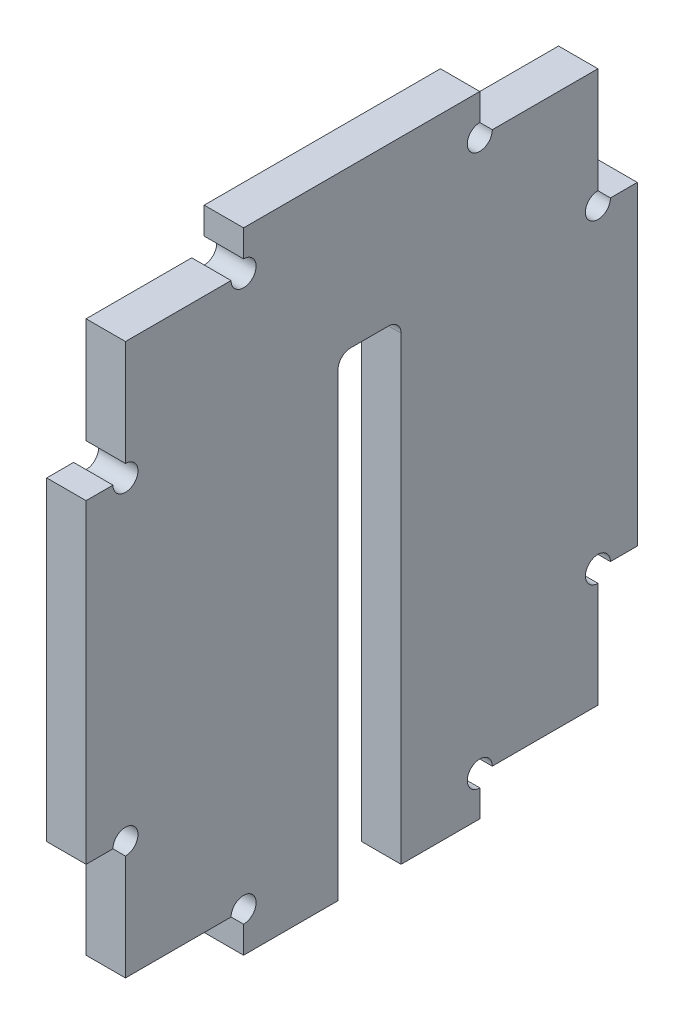
ISO-10303-21;
HEADER;
FILE_DESCRIPTION(('STEP AP214'),'2;1');
FILE_NAME('part.step','',(''),(''),'','','');
FILE_SCHEMA(('AUTOMOTIVE_DESIGN { 1 0 10303 214 1 1 1 1 }'));
ENDSEC;
DATA;
#1=APPLICATION_CONTEXT('core data for automotive mechanical design processes');
#2=APPLICATION_PROTOCOL_DEFINITION('international standard','automotive_design',2000,#1);
#3=PRODUCT_CONTEXT('',#1,'mechanical');
#4=PRODUCT('Part','Part','',(#3));
#5=PRODUCT_RELATED_PRODUCT_CATEGORY('part','',(#4));
#6=PRODUCT_DEFINITION_FORMATION('','',#4);
#7=PRODUCT_DEFINITION_CONTEXT('part definition',#1,'design');
#8=PRODUCT_DEFINITION('design','',#6,#7);
#9=PRODUCT_DEFINITION_SHAPE('','',#8);
#10=(LENGTH_UNIT() NAMED_UNIT(*) SI_UNIT(.MILLI.,.METRE.));
#11=(NAMED_UNIT(*) PLANE_ANGLE_UNIT() SI_UNIT($,.RADIAN.));
#12=(NAMED_UNIT(*) SI_UNIT($,.STERADIAN.) SOLID_ANGLE_UNIT());
#13=UNCERTAINTY_MEASURE_WITH_UNIT(LENGTH_MEASURE(1.E-05),#10,'distance_accuracy_value','');
#14=(GEOMETRIC_REPRESENTATION_CONTEXT(3) GLOBAL_UNCERTAINTY_ASSIGNED_CONTEXT((#13)) GLOBAL_UNIT_ASSIGNED_CONTEXT((#10,
#11,#12)) REPRESENTATION_CONTEXT('',''));
#15=CARTESIAN_POINT('',(0.,0.,0.));
#16=DIRECTION('',(0.,0.,1.));
#17=DIRECTION('',(1.,0.,0.));
#18=AXIS2_PLACEMENT_3D('',#15,#16,#17);
#19=CARTESIAN_POINT('',(5.,-40.,35.));
#20=DIRECTION('',(0.,1.,0.));
#21=DIRECTION('',(0.,0.,1.));
#22=AXIS2_PLACEMENT_3D('',#19,#20,#21);
#23=PLANE('',#22);
#24=DIRECTION('',(0.,0.,-1.));
#25=VECTOR('',#24,1.);
#26=CARTESIAN_POINT('',(0.,-40.,35.));
#27=LINE('',#26,#25);
#28=CARTESIAN_POINT('',(0.,-40.,15.));
#29=VERTEX_POINT('',#28);
#30=CARTESIAN_POINT('',(0.,-40.,2.99999999999998));
#31=VERTEX_POINT('',#30);
#32=EDGE_CURVE('E421',#29,#31,#27,.T.);
#33=ORIENTED_EDGE('',*,*,#32,.T.);
#34=DIRECTION('',(1.,0.,0.));
#35=VECTOR('',#34,1.);
#36=CARTESIAN_POINT('',(0.,-40.,2.99999999999998));
#37=LINE('',#36,#35);
#38=CARTESIAN_POINT('',(5.,-40.,2.99999999999998));
#39=VERTEX_POINT('',#38);
#40=EDGE_CURVE('E542',#31,#39,#37,.T.);
#41=ORIENTED_EDGE('',*,*,#40,.T.);
#42=DIRECTION('',(0.,0.,-1.));
#43=VECTOR('',#42,1.);
#44=CARTESIAN_POINT('',(5.,-40.,35.));
#45=LINE('',#44,#43);
#46=CARTESIAN_POINT('',(5.,-40.,15.));
#47=VERTEX_POINT('',#46);
#48=EDGE_CURVE('E429',#47,#39,#45,.T.);
#49=ORIENTED_EDGE('',*,*,#48,.F.);
#50=DIRECTION('',(1.,0.,0.));
#51=VECTOR('',#50,1.);
#52=CARTESIAN_POINT('',(0.,-40.,15.));
#53=LINE('',#52,#51);
#54=EDGE_CURVE('E351',#29,#47,#53,.T.);
#55=ORIENTED_EDGE('',*,*,#54,.F.);
#56=EDGE_LOOP('',(#33,#41,#49,#55));
#57=FACE_BOUND('',#56,.T.);
#58=ADVANCED_FACE('F40',(#57),#23,.F.);
#59=CARTESIAN_POINT('',(5.,0.,0.));
#60=DIRECTION('',(-1.,0.,0.));
#61=DIRECTION('',(0.,0.,1.));
#62=AXIS2_PLACEMENT_3D('',#59,#60,#61);
#63=PLANE('',#62);
#64=DIRECTION('',(0.,-1.,0.));
#65=VECTOR('',#64,1.);
#66=CARTESIAN_POINT('',(5.,0.,30.));
#67=LINE('',#66,#65);
#68=CARTESIAN_POINT('',(5.,35.,30.));
#69=VERTEX_POINT('',#68);
#70=CARTESIAN_POINT('',(5.,21.5875,30.));
#71=VERTEX_POINT('',#70);
#72=EDGE_CURVE('E405',#69,#71,#67,.T.);
#73=ORIENTED_EDGE('',*,*,#72,.T.);
#74=CARTESIAN_POINT('',(5.,20.,30.));
#75=DIRECTION('',(1.,0.,0.));
#76=DIRECTION('',(0.,0.,-1.));
#77=AXIS2_PLACEMENT_3D('',#74,#75,#76);
#78=CIRCLE('',#77,1.5875);
#79=CARTESIAN_POINT('',(5.,20.,31.5875));
#80=VERTEX_POINT('',#79);
#81=EDGE_CURVE('E482',#80,#71,#78,.T.);
#82=ORIENTED_EDGE('',*,*,#81,.F.);
#83=DIRECTION('',(0.,0.,1.));
#84=VECTOR('',#83,1.);
#85=CARTESIAN_POINT('',(5.,20.,0.));
#86=LINE('',#85,#84);
#87=CARTESIAN_POINT('',(5.,20.,35.));
#88=VERTEX_POINT('',#87);
#89=EDGE_CURVE('E395',#80,#88,#86,.T.);
#90=ORIENTED_EDGE('',*,*,#89,.T.);
#91=DIRECTION('',(0.,-1.,0.));
#92=VECTOR('',#91,1.);
#93=CARTESIAN_POINT('',(5.,-40.,35.));
#94=LINE('',#93,#92);
#95=CARTESIAN_POINT('',(5.,-20.,35.));
#96=VERTEX_POINT('',#95);
#97=EDGE_CURVE('E424',#88,#96,#94,.T.);
#98=ORIENTED_EDGE('',*,*,#97,.T.);
#99=DIRECTION('',(0.,0.,1.));
#100=VECTOR('',#99,1.);
#101=CARTESIAN_POINT('',(5.,-20.,0.));
#102=LINE('',#101,#100);
#103=CARTESIAN_POINT('',(5.,-20.,31.5875));
#104=VERTEX_POINT('',#103);
#105=EDGE_CURVE('E373',#104,#96,#102,.T.);
#106=ORIENTED_EDGE('',*,*,#105,.F.);
#107=CARTESIAN_POINT('',(5.,-20.,30.));
#108=DIRECTION('',(1.,0.,0.));
#109=DIRECTION('',(0.,0.,-1.));
#110=AXIS2_PLACEMENT_3D('',#107,#108,#109);
#111=CIRCLE('',#110,1.5875);
#112=CARTESIAN_POINT('',(5.,-21.5875,30.));
#113=VERTEX_POINT('',#112);
#114=EDGE_CURVE('E488',#113,#104,#111,.T.);
#115=ORIENTED_EDGE('',*,*,#114,.F.);
#116=DIRECTION('',(0.,1.,0.));
#117=VECTOR('',#116,1.);
#118=CARTESIAN_POINT('',(5.,0.,30.));
#119=LINE('',#118,#117);
#120=CARTESIAN_POINT('',(5.,-35.,30.));
#121=VERTEX_POINT('',#120);
#122=EDGE_CURVE('E369',#121,#113,#119,.T.);
#123=ORIENTED_EDGE('',*,*,#122,.F.);
#124=DIRECTION('',(0.,0.,1.));
#125=VECTOR('',#124,1.);
#126=CARTESIAN_POINT('',(5.,-35.,0.));
#127=LINE('',#126,#125);
#128=CARTESIAN_POINT('',(5.,-35.,16.5875));
#129=VERTEX_POINT('',#128);
#130=EDGE_CURVE('E366',#129,#121,#127,.T.);
#131=ORIENTED_EDGE('',*,*,#130,.F.);
#132=CARTESIAN_POINT('',(5.,-35.,15.));
#133=DIRECTION('',(1.,0.,0.));
#134=DIRECTION('',(0.,0.,-1.));
#135=AXIS2_PLACEMENT_3D('',#132,#133,#134);
#136=CIRCLE('',#135,1.5875);
#137=CARTESIAN_POINT('',(5.,-36.5875,15.));
#138=VERTEX_POINT('',#137);
#139=EDGE_CURVE('E645',#138,#129,#136,.T.);
#140=ORIENTED_EDGE('',*,*,#139,.F.);
#141=DIRECTION('',(0.,1.,0.));
#142=VECTOR('',#141,1.);
#143=CARTESIAN_POINT('',(5.,0.,15.));
#144=LINE('',#143,#142);
#145=EDGE_CURVE('E356',#47,#138,#144,.T.);
#146=ORIENTED_EDGE('',*,*,#145,.F.);
#147=ORIENTED_EDGE('',*,*,#48,.T.);
#148=DIRECTION('',(0.,-1.,0.));
#149=VECTOR('',#148,1.);
#150=CARTESIAN_POINT('',(5.,-40.,2.99999999999998));
#151=LINE('',#150,#149);
#152=CARTESIAN_POINT('',(5.,18.4125,2.99999999999998));
#153=VERTEX_POINT('',#152);
#154=EDGE_CURVE('E520',#153,#39,#151,.T.);
#155=ORIENTED_EDGE('',*,*,#154,.F.);
#156=CARTESIAN_POINT('',(5.,18.4125,1.41249999999998));
#157=DIRECTION('',(1.,0.,0.));
#158=DIRECTION('',(0.,0.,-1.));
#159=AXIS2_PLACEMENT_3D('',#156,#157,#158);
#160=CIRCLE('',#159,1.5875);
#161=CARTESIAN_POINT('',(5.,20.,1.41249999999998));
#162=VERTEX_POINT('',#161);
#163=EDGE_CURVE('E526',#162,#153,#160,.T.);
#164=ORIENTED_EDGE('',*,*,#163,.F.);
#165=DIRECTION('',(0.,0.,1.));
#166=VECTOR('',#165,1.);
#167=CARTESIAN_POINT('',(5.,20.,1.41249999999998));
#168=LINE('',#167,#166);
#169=CARTESIAN_POINT('',(5.,20.,-3.41250000000002));
#170=VERTEX_POINT('',#169);
#171=EDGE_CURVE('E553',#170,#162,#168,.T.);
#172=ORIENTED_EDGE('',*,*,#171,.F.);
#173=CARTESIAN_POINT('',(5.,18.4125,-3.41250000000002));
#174=DIRECTION('',(1.,0.,0.));
#175=DIRECTION('',(0.,0.,1.));
#176=AXIS2_PLACEMENT_3D('',#173,#174,#175);
#177=CIRCLE('',#176,1.5875);
#178=CARTESIAN_POINT('',(5.,18.4125,-5.00000000000002));
#179=VERTEX_POINT('',#178);
#180=EDGE_CURVE('E549',#179,#170,#177,.T.);
#181=ORIENTED_EDGE('',*,*,#180,.F.);
#182=DIRECTION('',(0.,1.,0.));
#183=VECTOR('',#182,1.);
#184=CARTESIAN_POINT('',(5.,-40.,-5.00000000000002));
#185=LINE('',#184,#183);
#186=CARTESIAN_POINT('',(5.,-40.,-5.00000000000002));
#187=VERTEX_POINT('',#186);
#188=EDGE_CURVE('E545',#187,#179,#185,.T.);
#189=ORIENTED_EDGE('',*,*,#188,.F.);
#190=CARTESIAN_POINT('',(5.,-40.,-15.));
#191=VERTEX_POINT('',#190);
#192=EDGE_CURVE('E428',#187,#191,#45,.T.);
#193=ORIENTED_EDGE('',*,*,#192,.T.);
#194=DIRECTION('',(0.,1.,0.));
#195=VECTOR('',#194,1.);
#196=CARTESIAN_POINT('',(5.,0.,-15.));
#197=LINE('',#196,#195);
#198=CARTESIAN_POINT('',(5.,-36.5875,-15.));
#199=VERTEX_POINT('',#198);
#200=EDGE_CURVE('E282',#191,#199,#197,.T.);
#201=ORIENTED_EDGE('',*,*,#200,.T.);
#202=CARTESIAN_POINT('',(5.,-35.,-15.));
#203=DIRECTION('',(1.,0.,0.));
#204=DIRECTION('',(0.,0.,-1.));
#205=AXIS2_PLACEMENT_3D('',#202,#203,#204);
#206=CIRCLE('',#205,1.5875);
#207=CARTESIAN_POINT('',(5.,-35.,-16.5875));
#208=VERTEX_POINT('',#207);
#209=EDGE_CURVE('E263',#208,#199,#206,.T.);
#210=ORIENTED_EDGE('',*,*,#209,.F.);
#211=DIRECTION('',(0.,0.,-1.));
#212=VECTOR('',#211,1.);
#213=CARTESIAN_POINT('',(5.,-35.,0.));
#214=LINE('',#213,#212);
#215=CARTESIAN_POINT('',(5.,-35.,-30.));
#216=VERTEX_POINT('',#215);
#217=EDGE_CURVE('E279',#208,#216,#214,.T.);
#218=ORIENTED_EDGE('',*,*,#217,.T.);
#219=DIRECTION('',(0.,1.,0.));
#220=VECTOR('',#219,1.);
#221=CARTESIAN_POINT('',(5.,0.,-30.));
#222=LINE('',#221,#220);
#223=CARTESIAN_POINT('',(5.,-21.5875,-30.));
#224=VERTEX_POINT('',#223);
#225=EDGE_CURVE('E292',#216,#224,#222,.T.);
#226=ORIENTED_EDGE('',*,*,#225,.T.);
#227=CARTESIAN_POINT('',(5.,-20.,-30.));
#228=DIRECTION('',(1.,0.,0.));
#229=DIRECTION('',(0.,0.,-1.));
#230=AXIS2_PLACEMENT_3D('',#227,#228,#229);
#231=CIRCLE('',#230,1.5875);
#232=CARTESIAN_POINT('',(5.,-20.,-31.5875));
#233=VERTEX_POINT('',#232);
#234=EDGE_CURVE('E607',#233,#224,#231,.T.);
#235=ORIENTED_EDGE('',*,*,#234,.F.);
#236=DIRECTION('',(0.,0.,-1.));
#237=VECTOR('',#236,1.);
#238=CARTESIAN_POINT('',(5.,-20.,0.));
#239=LINE('',#238,#237);
#240=CARTESIAN_POINT('',(5.,-20.,-35.));
#241=VERTEX_POINT('',#240);
#242=EDGE_CURVE('E298',#233,#241,#239,.T.);
#243=ORIENTED_EDGE('',*,*,#242,.T.);
#244=DIRECTION('',(0.,1.,0.));
#245=VECTOR('',#244,1.);
#246=CARTESIAN_POINT('',(5.,-40.,-35.));
#247=LINE('',#246,#245);
#248=CARTESIAN_POINT('',(5.,20.,-35.));
#249=VERTEX_POINT('',#248);
#250=EDGE_CURVE('E416',#241,#249,#247,.T.);
#251=ORIENTED_EDGE('',*,*,#250,.T.);
#252=DIRECTION('',(0.,0.,-1.));
#253=VECTOR('',#252,1.);
#254=CARTESIAN_POINT('',(5.,20.,0.));
#255=LINE('',#254,#253);
#256=CARTESIAN_POINT('',(5.,20.,-31.5875));
#257=VERTEX_POINT('',#256);
#258=EDGE_CURVE('E327',#257,#249,#255,.T.);
#259=ORIENTED_EDGE('',*,*,#258,.F.);
#260=CARTESIAN_POINT('',(5.,20.,-30.));
#261=DIRECTION('',(1.,0.,0.));
#262=DIRECTION('',(0.,0.,-1.));
#263=AXIS2_PLACEMENT_3D('',#260,#261,#262);
#264=CIRCLE('',#263,1.5875);
#265=CARTESIAN_POINT('',(5.,21.5875,-30.));
#266=VERTEX_POINT('',#265);
#267=EDGE_CURVE('E626',#266,#257,#264,.T.);
#268=ORIENTED_EDGE('',*,*,#267,.F.);
#269=DIRECTION('',(0.,-1.,0.));
#270=VECTOR('',#269,1.);
#271=CARTESIAN_POINT('',(5.,0.,-30.));
#272=LINE('',#271,#270);
#273=CARTESIAN_POINT('',(5.,35.,-30.));
#274=VERTEX_POINT('',#273);
#275=EDGE_CURVE('E333',#274,#266,#272,.T.);
#276=ORIENTED_EDGE('',*,*,#275,.F.);
#277=DIRECTION('',(0.,0.,-1.));
#278=VECTOR('',#277,1.);
#279=CARTESIAN_POINT('',(5.,35.,0.));
#280=LINE('',#279,#278);
#281=CARTESIAN_POINT('',(5.,35.,-16.5875));
#282=VERTEX_POINT('',#281);
#283=EDGE_CURVE('E330',#282,#274,#280,.T.);
#284=ORIENTED_EDGE('',*,*,#283,.F.);
#285=CARTESIAN_POINT('',(5.,35.,-15.));
#286=DIRECTION('',(1.,0.,0.));
#287=DIRECTION('',(0.,0.,-1.));
#288=AXIS2_PLACEMENT_3D('',#285,#286,#287);
#289=CIRCLE('',#288,1.5875);
#290=CARTESIAN_POINT('',(5.,36.5875,-15.));
#291=VERTEX_POINT('',#290);
#292=EDGE_CURVE('E625',#291,#282,#289,.T.);
#293=ORIENTED_EDGE('',*,*,#292,.F.);
#294=DIRECTION('',(0.,-1.,0.));
#295=VECTOR('',#294,1.);
#296=CARTESIAN_POINT('',(5.,0.,-15.));
#297=LINE('',#296,#295);
#298=CARTESIAN_POINT('',(5.,40.,-15.));
#299=VERTEX_POINT('',#298);
#300=EDGE_CURVE('E317',#299,#291,#297,.T.);
#301=ORIENTED_EDGE('',*,*,#300,.F.);
#302=DIRECTION('',(0.,0.,1.));
#303=VECTOR('',#302,1.);
#304=CARTESIAN_POINT('',(5.,40.,35.));
#305=LINE('',#304,#303);
#306=CARTESIAN_POINT('',(5.,40.,15.));
#307=VERTEX_POINT('',#306);
#308=EDGE_CURVE('E420',#299,#307,#305,.T.);
#309=ORIENTED_EDGE('',*,*,#308,.T.);
#310=DIRECTION('',(0.,-1.,0.));
#311=VECTOR('',#310,1.);
#312=CARTESIAN_POINT('',(5.,0.,15.));
#313=LINE('',#312,#311);
#314=CARTESIAN_POINT('',(5.,36.5875,15.));
#315=VERTEX_POINT('',#314);
#316=EDGE_CURVE('E411',#307,#315,#313,.T.);
#317=ORIENTED_EDGE('',*,*,#316,.T.);
#318=CARTESIAN_POINT('',(5.,35.,15.));
#319=DIRECTION('',(1.,0.,0.));
#320=DIRECTION('',(0.,0.,-1.));
#321=AXIS2_PLACEMENT_3D('',#318,#319,#320);
#322=CIRCLE('',#321,1.5875);
#323=CARTESIAN_POINT('',(5.,35.,16.5875));
#324=VERTEX_POINT('',#323);
#325=EDGE_CURVE('E494',#324,#315,#322,.T.);
#326=ORIENTED_EDGE('',*,*,#325,.F.);
#327=DIRECTION('',(0.,0.,1.));
#328=VECTOR('',#327,1.);
#329=CARTESIAN_POINT('',(5.,35.,0.));
#330=LINE('',#329,#328);
#331=EDGE_CURVE('E408',#324,#69,#330,.T.);
#332=ORIENTED_EDGE('',*,*,#331,.T.);
#333=EDGE_LOOP('',(#73,#82,#90,#98,#106,#115,#123,#131,#140,#146,#147,#155,#164,#172,#181,#189,
#193,#201,#210,#218,#226,#235,#243,#251,#259,#268,#276,#284,#293,#301,#309,#317,#326,#332));
#334=FACE_BOUND('',#333,.T.);
#335=ADVANCED_FACE('F277',(#334),#63,.F.);
#336=CARTESIAN_POINT('',(0.,0.,0.));
#337=DIRECTION('',(-1.,0.,0.));
#338=DIRECTION('',(0.,0.,1.));
#339=AXIS2_PLACEMENT_3D('',#336,#337,#338);
#340=PLANE('',#339);
#341=CARTESIAN_POINT('',(0.,20.,30.));
#342=DIRECTION('',(1.,0.,0.));
#343=DIRECTION('',(0.,0.,-1.));
#344=AXIS2_PLACEMENT_3D('',#341,#342,#343);
#345=CIRCLE('',#344,1.5875);
#346=CARTESIAN_POINT('',(0.,20.,31.5875));
#347=VERTEX_POINT('',#346);
#348=CARTESIAN_POINT('',(0.,21.5875,30.));
#349=VERTEX_POINT('',#348);
#350=EDGE_CURVE('E63',#347,#349,#345,.T.);
#351=ORIENTED_EDGE('',*,*,#350,.T.);
#352=DIRECTION('',(0.,1.,0.));
#353=VECTOR('',#352,1.);
#354=CARTESIAN_POINT('',(0.,20.,30.));
#355=LINE('',#354,#353);
#356=CARTESIAN_POINT('',(0.,35.,30.));
#357=VERTEX_POINT('',#356);
#358=EDGE_CURVE('E380',#349,#357,#355,.T.);
#359=ORIENTED_EDGE('',*,*,#358,.T.);
#360=DIRECTION('',(0.,0.,-1.));
#361=VECTOR('',#360,1.);
#362=CARTESIAN_POINT('',(0.,35.,30.));
#363=LINE('',#362,#361);
#364=CARTESIAN_POINT('',(0.,35.,16.5875));
#365=VERTEX_POINT('',#364);
#366=EDGE_CURVE('E383',#357,#365,#363,.T.);
#367=ORIENTED_EDGE('',*,*,#366,.T.);
#368=CARTESIAN_POINT('',(0.,35.,15.));
#369=DIRECTION('',(1.,0.,0.));
#370=DIRECTION('',(0.,0.,-1.));
#371=AXIS2_PLACEMENT_3D('',#368,#369,#370);
#372=CIRCLE('',#371,1.5875);
#373=CARTESIAN_POINT('',(0.,36.5875,15.));
#374=VERTEX_POINT('',#373);
#375=EDGE_CURVE('E56',#365,#374,#372,.T.);
#376=ORIENTED_EDGE('',*,*,#375,.T.);
#377=DIRECTION('',(0.,1.,0.));
#378=VECTOR('',#377,1.);
#379=CARTESIAN_POINT('',(0.,35.,15.));
#380=LINE('',#379,#378);
#381=CARTESIAN_POINT('',(0.,40.,15.));
#382=VERTEX_POINT('',#381);
#383=EDGE_CURVE('E387',#374,#382,#380,.T.);
#384=ORIENTED_EDGE('',*,*,#383,.T.);
#385=DIRECTION('',(0.,0.,1.));
#386=VECTOR('',#385,1.);
#387=CARTESIAN_POINT('',(0.,40.,35.));
#388=LINE('',#387,#386);
#389=CARTESIAN_POINT('',(0.,40.,-15.));
#390=VERTEX_POINT('',#389);
#391=EDGE_CURVE('E436',#390,#382,#388,.T.);
#392=ORIENTED_EDGE('',*,*,#391,.F.);
#393=DIRECTION('',(0.,1.,0.));
#394=VECTOR('',#393,1.);
#395=CARTESIAN_POINT('',(0.,35.,-15.));
#396=LINE('',#395,#394);
#397=CARTESIAN_POINT('',(0.,36.5875,-15.));
#398=VERTEX_POINT('',#397);
#399=EDGE_CURVE('E291',#398,#390,#396,.T.);
#400=ORIENTED_EDGE('',*,*,#399,.F.);
#401=CARTESIAN_POINT('',(0.,35.,-15.));
#402=DIRECTION('',(1.,0.,0.));
#403=DIRECTION('',(0.,0.,-1.));
#404=AXIS2_PLACEMENT_3D('',#401,#402,#403);
#405=CIRCLE('',#404,1.5875);
#406=CARTESIAN_POINT('',(0.,35.,-16.5875));
#407=VERTEX_POINT('',#406);
#408=EDGE_CURVE('E496',#398,#407,#405,.T.);
#409=ORIENTED_EDGE('',*,*,#408,.T.);
#410=DIRECTION('',(0.,0.,1.));
#411=VECTOR('',#410,1.);
#412=CARTESIAN_POINT('',(0.,35.,-30.));
#413=LINE('',#412,#411);
#414=CARTESIAN_POINT('',(0.,35.,-30.));
#415=VERTEX_POINT('',#414);
#416=EDGE_CURVE('E296',#415,#407,#413,.T.);
#417=ORIENTED_EDGE('',*,*,#416,.F.);
#418=DIRECTION('',(0.,1.,0.));
#419=VECTOR('',#418,1.);
#420=CARTESIAN_POINT('',(0.,20.,-30.));
#421=LINE('',#420,#419);
#422=CARTESIAN_POINT('',(0.,21.5875,-30.));
#423=VERTEX_POINT('',#422);
#424=EDGE_CURVE('E305',#423,#415,#421,.T.);
#425=ORIENTED_EDGE('',*,*,#424,.F.);
#426=CARTESIAN_POINT('',(0.,20.,-30.));
#427=DIRECTION('',(1.,0.,0.));
#428=DIRECTION('',(0.,0.,-1.));
#429=AXIS2_PLACEMENT_3D('',#426,#427,#428);
#430=CIRCLE('',#429,1.5875);
#431=CARTESIAN_POINT('',(0.,20.,-31.5875));
#432=VERTEX_POINT('',#431);
#433=EDGE_CURVE('E620',#423,#432,#430,.T.);
#434=ORIENTED_EDGE('',*,*,#433,.T.);
#435=DIRECTION('',(0.,0.,1.));
#436=VECTOR('',#435,1.);
#437=CARTESIAN_POINT('',(0.,20.,-35.));
#438=LINE('',#437,#436);
#439=CARTESIAN_POINT('',(0.,20.,-35.));
#440=VERTEX_POINT('',#439);
#441=EDGE_CURVE('E308',#440,#432,#438,.T.);
#442=ORIENTED_EDGE('',*,*,#441,.F.);
#443=DIRECTION('',(0.,1.,0.));
#444=VECTOR('',#443,1.);
#445=CARTESIAN_POINT('',(0.,-40.,-35.));
#446=LINE('',#445,#444);
#447=CARTESIAN_POINT('',(0.,-20.,-35.));
#448=VERTEX_POINT('',#447);
#449=EDGE_CURVE('E415',#448,#440,#446,.T.);
#450=ORIENTED_EDGE('',*,*,#449,.F.);
#451=DIRECTION('',(0.,0.,1.));
#452=VECTOR('',#451,1.);
#453=CARTESIAN_POINT('',(0.,-20.,-35.));
#454=LINE('',#453,#452);
#455=CARTESIAN_POINT('',(0.,-20.,-31.5875));
#456=VERTEX_POINT('',#455);
#457=EDGE_CURVE('E563',#448,#456,#454,.T.);
#458=ORIENTED_EDGE('',*,*,#457,.T.);
#459=CARTESIAN_POINT('',(0.,-20.,-30.));
#460=DIRECTION('',(1.,0.,0.));
#461=DIRECTION('',(0.,0.,-1.));
#462=AXIS2_PLACEMENT_3D('',#459,#460,#461);
#463=CIRCLE('',#462,1.5875);
#464=CARTESIAN_POINT('',(0.,-21.5875,-30.));
#465=VERTEX_POINT('',#464);
#466=EDGE_CURVE('E631',#456,#465,#463,.T.);
#467=ORIENTED_EDGE('',*,*,#466,.T.);
#468=DIRECTION('',(0.,-1.,0.));
#469=VECTOR('',#468,1.);
#470=CARTESIAN_POINT('',(0.,-20.,-30.));
#471=LINE('',#470,#469);
#472=CARTESIAN_POINT('',(0.,-35.,-30.));
#473=VERTEX_POINT('',#472);
#474=EDGE_CURVE('E582',#465,#473,#471,.T.);
#475=ORIENTED_EDGE('',*,*,#474,.T.);
#476=DIRECTION('',(0.,0.,1.));
#477=VECTOR('',#476,1.);
#478=CARTESIAN_POINT('',(0.,-35.,-30.));
#479=LINE('',#478,#477);
#480=CARTESIAN_POINT('',(0.,-35.,-16.5875));
#481=VERTEX_POINT('',#480);
#482=EDGE_CURVE('E585',#473,#481,#479,.T.);
#483=ORIENTED_EDGE('',*,*,#482,.T.);
#484=CARTESIAN_POINT('',(0.,-35.,-15.));
#485=DIRECTION('',(1.,0.,0.));
#486=DIRECTION('',(0.,0.,-1.));
#487=AXIS2_PLACEMENT_3D('',#484,#485,#486);
#488=CIRCLE('',#487,1.5875);
#489=CARTESIAN_POINT('',(0.,-36.5875,-15.));
#490=VERTEX_POINT('',#489);
#491=EDGE_CURVE('E266',#481,#490,#488,.T.);
#492=ORIENTED_EDGE('',*,*,#491,.T.);
#493=DIRECTION('',(0.,-1.,0.));
#494=VECTOR('',#493,1.);
#495=CARTESIAN_POINT('',(0.,-35.,-15.));
#496=LINE('',#495,#494);
#497=CARTESIAN_POINT('',(0.,-40.,-15.));
#498=VERTEX_POINT('',#497);
#499=EDGE_CURVE('E588',#490,#498,#496,.T.);
#500=ORIENTED_EDGE('',*,*,#499,.T.);
#501=CARTESIAN_POINT('',(0.,-40.,-5.00000000000002));
#502=VERTEX_POINT('',#501);
#503=EDGE_CURVE('E444',#502,#498,#27,.T.);
#504=ORIENTED_EDGE('',*,*,#503,.F.);
#505=DIRECTION('',(0.,1.,0.));
#506=VECTOR('',#505,1.);
#507=CARTESIAN_POINT('',(0.,-40.,-5.00000000000002));
#508=LINE('',#507,#506);
#509=CARTESIAN_POINT('',(0.,18.4125,-5.00000000000002));
#510=VERTEX_POINT('',#509);
#511=EDGE_CURVE('E525',#502,#510,#508,.T.);
#512=ORIENTED_EDGE('',*,*,#511,.T.);
#513=CARTESIAN_POINT('',(0.,18.4125,-3.41250000000002));
#514=DIRECTION('',(1.,0.,0.));
#515=DIRECTION('',(0.,0.,1.));
#516=AXIS2_PLACEMENT_3D('',#513,#514,#515);
#517=CIRCLE('',#516,1.5875);
#518=CARTESIAN_POINT('',(0.,20.,-3.41250000000002));
#519=VERTEX_POINT('',#518);
#520=EDGE_CURVE('E530',#510,#519,#517,.T.);
#521=ORIENTED_EDGE('',*,*,#520,.T.);
#522=DIRECTION('',(0.,0.,1.));
#523=VECTOR('',#522,1.);
#524=CARTESIAN_POINT('',(0.,20.,1.41249999999998));
#525=LINE('',#524,#523);
#526=CARTESIAN_POINT('',(0.,20.,1.41249999999998));
#527=VERTEX_POINT('',#526);
#528=EDGE_CURVE('E534',#519,#527,#525,.T.);
#529=ORIENTED_EDGE('',*,*,#528,.T.);
#530=CARTESIAN_POINT('',(0.,18.4125,1.41249999999998));
#531=DIRECTION('',(1.,0.,0.));
#532=DIRECTION('',(0.,0.,-1.));
#533=AXIS2_PLACEMENT_3D('',#530,#531,#532);
#534=CIRCLE('',#533,1.5875);
#535=CARTESIAN_POINT('',(0.,18.4125,2.99999999999998));
#536=VERTEX_POINT('',#535);
#537=EDGE_CURVE('E538',#527,#536,#534,.T.);
#538=ORIENTED_EDGE('',*,*,#537,.T.);
#539=DIRECTION('',(0.,-1.,0.));
#540=VECTOR('',#539,1.);
#541=CARTESIAN_POINT('',(0.,-40.,2.99999999999998));
#542=LINE('',#541,#540);
#543=EDGE_CURVE('E521',#536,#31,#542,.T.);
#544=ORIENTED_EDGE('',*,*,#543,.T.);
#545=ORIENTED_EDGE('',*,*,#32,.F.);
#546=DIRECTION('',(0.,-1.,0.));
#547=VECTOR('',#546,1.);
#548=CARTESIAN_POINT('',(0.,-35.,15.));
#549=LINE('',#548,#547);
#550=CARTESIAN_POINT('',(0.,-36.5875,15.));
#551=VERTEX_POINT('',#550);
#552=EDGE_CURVE('E337',#551,#29,#549,.T.);
#553=ORIENTED_EDGE('',*,*,#552,.F.);
#554=CARTESIAN_POINT('',(0.,-35.,15.));
#555=DIRECTION('',(1.,0.,0.));
#556=DIRECTION('',(0.,0.,-1.));
#557=AXIS2_PLACEMENT_3D('',#554,#555,#556);
#558=CIRCLE('',#557,1.5875);
#559=CARTESIAN_POINT('',(0.,-35.,16.5875));
#560=VERTEX_POINT('',#559);
#561=EDGE_CURVE('E284',#551,#560,#558,.T.);
#562=ORIENTED_EDGE('',*,*,#561,.T.);
#563=DIRECTION('',(0.,0.,-1.));
#564=VECTOR('',#563,1.);
#565=CARTESIAN_POINT('',(0.,-35.,30.));
#566=LINE('',#565,#564);
#567=CARTESIAN_POINT('',(0.,-35.,30.));
#568=VERTEX_POINT('',#567);
#569=EDGE_CURVE('E340',#568,#560,#566,.T.);
#570=ORIENTED_EDGE('',*,*,#569,.F.);
#571=DIRECTION('',(0.,-1.,0.));
#572=VECTOR('',#571,1.);
#573=CARTESIAN_POINT('',(0.,-20.,30.));
#574=LINE('',#573,#572);
#575=CARTESIAN_POINT('',(0.,-21.5875,30.));
#576=VERTEX_POINT('',#575);
#577=EDGE_CURVE('E344',#576,#568,#574,.T.);
#578=ORIENTED_EDGE('',*,*,#577,.F.);
#579=CARTESIAN_POINT('',(0.,-20.,30.));
#580=DIRECTION('',(1.,0.,0.));
#581=DIRECTION('',(0.,0.,-1.));
#582=AXIS2_PLACEMENT_3D('',#579,#580,#581);
#583=CIRCLE('',#582,1.5875);
#584=CARTESIAN_POINT('',(0.,-20.,31.5875));
#585=VERTEX_POINT('',#584);
#586=EDGE_CURVE('E648',#576,#585,#583,.T.);
#587=ORIENTED_EDGE('',*,*,#586,.T.);
#588=DIRECTION('',(0.,0.,-1.));
#589=VECTOR('',#588,1.);
#590=CARTESIAN_POINT('',(0.,-20.,35.));
#591=LINE('',#590,#589);
#592=CARTESIAN_POINT('',(0.,-20.,35.));
#593=VERTEX_POINT('',#592);
#594=EDGE_CURVE('E347',#593,#585,#591,.T.);
#595=ORIENTED_EDGE('',*,*,#594,.F.);
#596=DIRECTION('',(0.,-1.,0.));
#597=VECTOR('',#596,1.);
#598=CARTESIAN_POINT('',(0.,-40.,35.));
#599=LINE('',#598,#597);
#600=CARTESIAN_POINT('',(0.,20.,35.));
#601=VERTEX_POINT('',#600);
#602=EDGE_CURVE('E440',#601,#593,#599,.T.);
#603=ORIENTED_EDGE('',*,*,#602,.F.);
#604=DIRECTION('',(0.,0.,-1.));
#605=VECTOR('',#604,1.);
#606=CARTESIAN_POINT('',(0.,20.,35.));
#607=LINE('',#606,#605);
#608=EDGE_CURVE('E376',#601,#347,#607,.T.);
#609=ORIENTED_EDGE('',*,*,#608,.T.);
#610=EDGE_LOOP('',(#351,#359,#367,#376,#384,#392,#400,#409,#417,#425,#434,#442,#450,#458,#467,
#475,#483,#492,#500,#504,#512,#521,#529,#538,#544,#545,#553,#562,#570,#578,#587,#595,#603,#609));
#611=FACE_BOUND('',#610,.T.);
#612=ADVANCED_FACE('F473',(#611),#340,.T.);
#613=CARTESIAN_POINT('',(5.,-40.,-35.));
#614=DIRECTION('',(0.,0.,1.));
#615=DIRECTION('',(1.,0.,0.));
#616=AXIS2_PLACEMENT_3D('',#613,#614,#615);
#617=PLANE('',#616);
#618=ORIENTED_EDGE('',*,*,#250,.F.);
#619=DIRECTION('',(1.,0.,0.));
#620=VECTOR('',#619,1.);
#621=CARTESIAN_POINT('',(0.,-20.,-35.));
#622=LINE('',#621,#620);
#623=EDGE_CURVE('E591',#448,#241,#622,.T.);
#624=ORIENTED_EDGE('',*,*,#623,.F.);
#625=ORIENTED_EDGE('',*,*,#449,.T.);
#626=DIRECTION('',(1.,0.,0.));
#627=VECTOR('',#626,1.);
#628=CARTESIAN_POINT('',(0.,20.,-35.));
#629=LINE('',#628,#627);
#630=EDGE_CURVE('E313',#440,#249,#629,.T.);
#631=ORIENTED_EDGE('',*,*,#630,.T.);
#632=EDGE_LOOP('',(#618,#624,#625,#631));
#633=FACE_BOUND('',#632,.T.);
#634=ADVANCED_FACE('F42',(#633),#617,.F.);
#635=CARTESIAN_POINT('',(5.,40.,35.));
#636=DIRECTION('',(0.,-1.,0.));
#637=DIRECTION('',(0.,0.,-1.));
#638=AXIS2_PLACEMENT_3D('',#635,#636,#637);
#639=PLANE('',#638);
#640=DIRECTION('',(1.,0.,0.));
#641=VECTOR('',#640,1.);
#642=CARTESIAN_POINT('',(0.,40.,-15.));
#643=LINE('',#642,#641);
#644=EDGE_CURVE('E312',#390,#299,#643,.T.);
#645=ORIENTED_EDGE('',*,*,#644,.F.);
#646=ORIENTED_EDGE('',*,*,#391,.T.);
#647=DIRECTION('',(1.,0.,0.));
#648=VECTOR('',#647,1.);
#649=CARTESIAN_POINT('',(0.,40.,15.));
#650=LINE('',#649,#648);
#651=EDGE_CURVE('E391',#382,#307,#650,.T.);
#652=ORIENTED_EDGE('',*,*,#651,.T.);
#653=ORIENTED_EDGE('',*,*,#308,.F.);
#654=EDGE_LOOP('',(#645,#646,#652,#653));
#655=FACE_BOUND('',#654,.T.);
#656=ADVANCED_FACE('F691',(#655),#639,.F.);
#657=CARTESIAN_POINT('',(5.,-40.,35.));
#658=DIRECTION('',(0.,0.,-1.));
#659=DIRECTION('',(-1.,0.,0.));
#660=AXIS2_PLACEMENT_3D('',#657,#658,#659);
#661=PLANE('',#660);
#662=DIRECTION('',(1.,0.,0.));
#663=VECTOR('',#662,1.);
#664=CARTESIAN_POINT('',(0.,-20.,35.));
#665=LINE('',#664,#663);
#666=EDGE_CURVE('E352',#593,#96,#665,.T.);
#667=ORIENTED_EDGE('',*,*,#666,.T.);
#668=ORIENTED_EDGE('',*,*,#97,.F.);
#669=DIRECTION('',(1.,0.,0.));
#670=VECTOR('',#669,1.);
#671=CARTESIAN_POINT('',(0.,20.,35.));
#672=LINE('',#671,#670);
#673=EDGE_CURVE('E390',#601,#88,#672,.T.);
#674=ORIENTED_EDGE('',*,*,#673,.F.);
#675=ORIENTED_EDGE('',*,*,#602,.T.);
#676=EDGE_LOOP('',(#667,#668,#674,#675));
#677=FACE_BOUND('',#676,.T.);
#678=ADVANCED_FACE('F478',(#677),#661,.F.);
#679=ORIENTED_EDGE('',*,*,#192,.F.);
#680=DIRECTION('',(1.,0.,0.));
#681=VECTOR('',#680,1.);
#682=CARTESIAN_POINT('',(0.,-40.,-5.00000000000002));
#683=LINE('',#682,#681);
#684=EDGE_CURVE('E573',#502,#187,#683,.T.);
#685=ORIENTED_EDGE('',*,*,#684,.F.);
#686=ORIENTED_EDGE('',*,*,#503,.T.);
#687=DIRECTION('',(1.,0.,0.));
#688=VECTOR('',#687,1.);
#689=CARTESIAN_POINT('',(0.,-40.,-15.));
#690=LINE('',#689,#688);
#691=EDGE_CURVE('E592',#498,#191,#690,.T.);
#692=ORIENTED_EDGE('',*,*,#691,.T.);
#693=EDGE_LOOP('',(#679,#685,#686,#692));
#694=FACE_BOUND('',#693,.T.);
#695=ADVANCED_FACE('F674',(#694),#23,.F.);
#696=CARTESIAN_POINT('',(0.,35.,15.));
#697=DIRECTION('',(0.,0.,-1.));
#698=DIRECTION('',(-1.,0.,0.));
#699=AXIS2_PLACEMENT_3D('',#696,#697,#698);
#700=PLANE('',#699);
#701=ORIENTED_EDGE('',*,*,#383,.F.);
#702=DIRECTION('',(1.,0.,0.));
#703=VECTOR('',#702,1.);
#704=CARTESIAN_POINT('',(0.,36.5875,15.));
#705=LINE('',#704,#703);
#706=EDGE_CURVE('E516',#374,#315,#705,.T.);
#707=ORIENTED_EDGE('',*,*,#706,.T.);
#708=ORIENTED_EDGE('',*,*,#316,.F.);
#709=ORIENTED_EDGE('',*,*,#651,.F.);
#710=EDGE_LOOP('',(#701,#707,#708,#709));
#711=FACE_BOUND('',#710,.T.);
#712=ADVANCED_FACE('F682',(#711),#700,.F.);
#713=CARTESIAN_POINT('',(0.,35.,30.));
#714=DIRECTION('',(0.,-1.,0.));
#715=DIRECTION('',(0.,0.,-1.));
#716=AXIS2_PLACEMENT_3D('',#713,#714,#715);
#717=PLANE('',#716);
#718=ORIENTED_EDGE('',*,*,#331,.F.);
#719=DIRECTION('',(1.,0.,0.));
#720=VECTOR('',#719,1.);
#721=CARTESIAN_POINT('',(0.,35.,16.5875));
#722=LINE('',#721,#720);
#723=EDGE_CURVE('E11',#324,#365,#722,.F.);
#724=ORIENTED_EDGE('',*,*,#723,.T.);
#725=ORIENTED_EDGE('',*,*,#366,.F.);
#726=DIRECTION('',(1.,0.,0.));
#727=VECTOR('',#726,1.);
#728=CARTESIAN_POINT('',(0.,35.,30.));
#729=LINE('',#728,#727);
#730=EDGE_CURVE('E396',#357,#69,#729,.T.);
#731=ORIENTED_EDGE('',*,*,#730,.T.);
#732=EDGE_LOOP('',(#718,#724,#725,#731));
#733=FACE_BOUND('',#732,.T.);
#734=ADVANCED_FACE('F688',(#733),#717,.F.);
#735=CARTESIAN_POINT('',(0.,20.,30.));
#736=DIRECTION('',(0.,0.,-1.));
#737=DIRECTION('',(-1.,0.,0.));
#738=AXIS2_PLACEMENT_3D('',#735,#736,#737);
#739=PLANE('',#738);
#740=ORIENTED_EDGE('',*,*,#358,.F.);
#741=DIRECTION('',(1.,0.,0.));
#742=VECTOR('',#741,1.);
#743=CARTESIAN_POINT('',(0.,21.5875,30.));
#744=LINE('',#743,#742);
#745=EDGE_CURVE('E513',#349,#71,#744,.T.);
#746=ORIENTED_EDGE('',*,*,#745,.T.);
#747=ORIENTED_EDGE('',*,*,#72,.F.);
#748=ORIENTED_EDGE('',*,*,#730,.F.);
#749=EDGE_LOOP('',(#740,#746,#747,#748));
#750=FACE_BOUND('',#749,.T.);
#751=ADVANCED_FACE('F668',(#750),#739,.F.);
#752=CARTESIAN_POINT('',(0.,20.,35.));
#753=DIRECTION('',(0.,-1.,0.));
#754=DIRECTION('',(0.,0.,-1.));
#755=AXIS2_PLACEMENT_3D('',#752,#753,#754);
#756=PLANE('',#755);
#757=ORIENTED_EDGE('',*,*,#89,.F.);
#758=DIRECTION('',(1.,0.,0.));
#759=VECTOR('',#758,1.);
#760=CARTESIAN_POINT('',(0.,20.,31.5875));
#761=LINE('',#760,#759);
#762=EDGE_CURVE('E49',#80,#347,#761,.F.);
#763=ORIENTED_EDGE('',*,*,#762,.T.);
#764=ORIENTED_EDGE('',*,*,#608,.F.);
#765=ORIENTED_EDGE('',*,*,#673,.T.);
#766=EDGE_LOOP('',(#757,#763,#764,#765));
#767=FACE_BOUND('',#766,.T.);
#768=ADVANCED_FACE('F468',(#767),#756,.F.);
#769=CARTESIAN_POINT('',(0.,-20.,35.));
#770=DIRECTION('',(0.,-1.,0.));
#771=DIRECTION('',(0.,0.,-1.));
#772=AXIS2_PLACEMENT_3D('',#769,#770,#771);
#773=PLANE('',#772);
#774=DIRECTION('',(1.,0.,0.));
#775=VECTOR('',#774,1.);
#776=CARTESIAN_POINT('',(0.,-20.,31.5875));
#777=LINE('',#776,#775);
#778=EDGE_CURVE('E510',#104,#585,#777,.F.);
#779=ORIENTED_EDGE('',*,*,#778,.F.);
#780=ORIENTED_EDGE('',*,*,#105,.T.);
#781=ORIENTED_EDGE('',*,*,#666,.F.);
#782=ORIENTED_EDGE('',*,*,#594,.T.);
#783=EDGE_LOOP('',(#779,#780,#781,#782));
#784=FACE_BOUND('',#783,.T.);
#785=ADVANCED_FACE('F657',(#784),#773,.T.);
#786=CARTESIAN_POINT('',(0.,-20.,30.));
#787=DIRECTION('',(0.,0.,1.));
#788=DIRECTION('',(1.,0.,0.));
#789=AXIS2_PLACEMENT_3D('',#786,#787,#788);
#790=PLANE('',#789);
#791=DIRECTION('',(1.,0.,0.));
#792=VECTOR('',#791,1.);
#793=CARTESIAN_POINT('',(0.,-21.5875,30.));
#794=LINE('',#793,#792);
#795=EDGE_CURVE('E463',#576,#113,#794,.T.);
#796=ORIENTED_EDGE('',*,*,#795,.F.);
#797=ORIENTED_EDGE('',*,*,#577,.T.);
#798=DIRECTION('',(1.,0.,0.));
#799=VECTOR('',#798,1.);
#800=CARTESIAN_POINT('',(0.,-35.,30.));
#801=LINE('',#800,#799);
#802=EDGE_CURVE('E357',#568,#121,#801,.T.);
#803=ORIENTED_EDGE('',*,*,#802,.T.);
#804=ORIENTED_EDGE('',*,*,#122,.T.);
#805=EDGE_LOOP('',(#796,#797,#803,#804));
#806=FACE_BOUND('',#805,.T.);
#807=ADVANCED_FACE('F659',(#806),#790,.T.);
#808=CARTESIAN_POINT('',(0.,-35.,30.));
#809=DIRECTION('',(0.,-1.,0.));
#810=DIRECTION('',(0.,0.,-1.));
#811=AXIS2_PLACEMENT_3D('',#808,#809,#810);
#812=PLANE('',#811);
#813=DIRECTION('',(1.,0.,0.));
#814=VECTOR('',#813,1.);
#815=CARTESIAN_POINT('',(0.,-35.,16.5875));
#816=LINE('',#815,#814);
#817=EDGE_CURVE('E507',#129,#560,#816,.F.);
#818=ORIENTED_EDGE('',*,*,#817,.F.);
#819=ORIENTED_EDGE('',*,*,#130,.T.);
#820=ORIENTED_EDGE('',*,*,#802,.F.);
#821=ORIENTED_EDGE('',*,*,#569,.T.);
#822=EDGE_LOOP('',(#818,#819,#820,#821));
#823=FACE_BOUND('',#822,.T.);
#824=ADVANCED_FACE('F665',(#823),#812,.T.);
#825=CARTESIAN_POINT('',(0.,-35.,15.));
#826=DIRECTION('',(0.,0.,1.));
#827=DIRECTION('',(1.,0.,0.));
#828=AXIS2_PLACEMENT_3D('',#825,#826,#827);
#829=PLANE('',#828);
#830=DIRECTION('',(1.,0.,0.));
#831=VECTOR('',#830,1.);
#832=CARTESIAN_POINT('',(0.,-36.5875,15.));
#833=LINE('',#832,#831);
#834=EDGE_CURVE('E460',#551,#138,#833,.T.);
#835=ORIENTED_EDGE('',*,*,#834,.F.);
#836=ORIENTED_EDGE('',*,*,#552,.T.);
#837=ORIENTED_EDGE('',*,*,#54,.T.);
#838=ORIENTED_EDGE('',*,*,#145,.T.);
#839=EDGE_LOOP('',(#835,#836,#837,#838));
#840=FACE_BOUND('',#839,.T.);
#841=ADVANCED_FACE('F768',(#840),#829,.T.);
#842=CARTESIAN_POINT('',(0.,20.,-30.));
#843=DIRECTION('',(0.,0.,-1.));
#844=DIRECTION('',(-1.,0.,0.));
#845=AXIS2_PLACEMENT_3D('',#842,#843,#844);
#846=PLANE('',#845);
#847=DIRECTION('',(1.,0.,0.));
#848=VECTOR('',#847,1.);
#849=CARTESIAN_POINT('',(0.,21.5875,-30.));
#850=LINE('',#849,#848);
#851=EDGE_CURVE('E504',#423,#266,#850,.T.);
#852=ORIENTED_EDGE('',*,*,#851,.F.);
#853=ORIENTED_EDGE('',*,*,#424,.T.);
#854=DIRECTION('',(1.,0.,0.));
#855=VECTOR('',#854,1.);
#856=CARTESIAN_POINT('',(0.,35.,-30.));
#857=LINE('',#856,#855);
#858=EDGE_CURVE('E318',#415,#274,#857,.T.);
#859=ORIENTED_EDGE('',*,*,#858,.T.);
#860=ORIENTED_EDGE('',*,*,#275,.T.);
#861=EDGE_LOOP('',(#852,#853,#859,#860));
#862=FACE_BOUND('',#861,.T.);
#863=ADVANCED_FACE('F765',(#862),#846,.T.);
#864=CARTESIAN_POINT('',(0.,35.,-30.));
#865=DIRECTION('',(0.,1.,0.));
#866=DIRECTION('',(0.,0.,1.));
#867=AXIS2_PLACEMENT_3D('',#864,#865,#866);
#868=PLANE('',#867);
#869=DIRECTION('',(1.,0.,0.));
#870=VECTOR('',#869,1.);
#871=CARTESIAN_POINT('',(0.,35.,-16.5875));
#872=LINE('',#871,#870);
#873=EDGE_CURVE('E501',#282,#407,#872,.F.);
#874=ORIENTED_EDGE('',*,*,#873,.F.);
#875=ORIENTED_EDGE('',*,*,#283,.T.);
#876=ORIENTED_EDGE('',*,*,#858,.F.);
#877=ORIENTED_EDGE('',*,*,#416,.T.);
#878=EDGE_LOOP('',(#874,#875,#876,#877));
#879=FACE_BOUND('',#878,.T.);
#880=ADVANCED_FACE('F764',(#879),#868,.T.);
#881=CARTESIAN_POINT('',(0.,20.,-35.));
#882=DIRECTION('',(0.,1.,0.));
#883=DIRECTION('',(0.,0.,1.));
#884=AXIS2_PLACEMENT_3D('',#881,#882,#883);
#885=PLANE('',#884);
#886=DIRECTION('',(1.,0.,0.));
#887=VECTOR('',#886,1.);
#888=CARTESIAN_POINT('',(0.,20.,-31.5875));
#889=LINE('',#888,#887);
#890=EDGE_CURVE('E457',#257,#432,#889,.F.);
#891=ORIENTED_EDGE('',*,*,#890,.F.);
#892=ORIENTED_EDGE('',*,*,#258,.T.);
#893=ORIENTED_EDGE('',*,*,#630,.F.);
#894=ORIENTED_EDGE('',*,*,#441,.T.);
#895=EDGE_LOOP('',(#891,#892,#893,#894));
#896=FACE_BOUND('',#895,.T.);
#897=ADVANCED_FACE('F617',(#896),#885,.T.);
#898=CARTESIAN_POINT('',(0.,35.,-15.));
#899=DIRECTION('',(0.,0.,-1.));
#900=DIRECTION('',(-1.,0.,0.));
#901=AXIS2_PLACEMENT_3D('',#898,#899,#900);
#902=PLANE('',#901);
#903=DIRECTION('',(1.,0.,0.));
#904=VECTOR('',#903,1.);
#905=CARTESIAN_POINT('',(0.,36.5875,-15.));
#906=LINE('',#905,#904);
#907=EDGE_CURVE('E454',#398,#291,#906,.T.);
#908=ORIENTED_EDGE('',*,*,#907,.F.);
#909=ORIENTED_EDGE('',*,*,#399,.T.);
#910=ORIENTED_EDGE('',*,*,#644,.T.);
#911=ORIENTED_EDGE('',*,*,#300,.T.);
#912=EDGE_LOOP('',(#908,#909,#910,#911));
#913=FACE_BOUND('',#912,.T.);
#914=ADVANCED_FACE('F757',(#913),#902,.T.);
#915=CARTESIAN_POINT('',(0.,-35.,-30.));
#916=DIRECTION('',(0.,1.,0.));
#917=DIRECTION('',(0.,0.,1.));
#918=AXIS2_PLACEMENT_3D('',#915,#916,#917);
#919=PLANE('',#918);
#920=ORIENTED_EDGE('',*,*,#217,.F.);
#921=DIRECTION('',(1.,0.,0.));
#922=VECTOR('',#921,1.);
#923=CARTESIAN_POINT('',(0.,-35.,-16.5875));
#924=LINE('',#923,#922);
#925=EDGE_CURVE('E260',#208,#481,#924,.F.);
#926=ORIENTED_EDGE('',*,*,#925,.T.);
#927=ORIENTED_EDGE('',*,*,#482,.F.);
#928=DIRECTION('',(1.,0.,0.));
#929=VECTOR('',#928,1.);
#930=CARTESIAN_POINT('',(0.,-35.,-30.));
#931=LINE('',#930,#929);
#932=EDGE_CURVE('E289',#473,#216,#931,.T.);
#933=ORIENTED_EDGE('',*,*,#932,.T.);
#934=EDGE_LOOP('',(#920,#926,#927,#933));
#935=FACE_BOUND('',#934,.T.);
#936=ADVANCED_FACE('F287',(#935),#919,.F.);
#937=CARTESIAN_POINT('',(0.,-20.,-30.));
#938=DIRECTION('',(0.,0.,1.));
#939=DIRECTION('',(1.,0.,0.));
#940=AXIS2_PLACEMENT_3D('',#937,#938,#939);
#941=PLANE('',#940);
#942=ORIENTED_EDGE('',*,*,#474,.F.);
#943=DIRECTION('',(1.,0.,0.));
#944=VECTOR('',#943,1.);
#945=CARTESIAN_POINT('',(0.,-21.5875,-30.));
#946=LINE('',#945,#944);
#947=EDGE_CURVE('E272',#465,#224,#946,.T.);
#948=ORIENTED_EDGE('',*,*,#947,.T.);
#949=ORIENTED_EDGE('',*,*,#225,.F.);
#950=ORIENTED_EDGE('',*,*,#932,.F.);
#951=EDGE_LOOP('',(#942,#948,#949,#950));
#952=FACE_BOUND('',#951,.T.);
#953=ADVANCED_FACE('F705',(#952),#941,.F.);
#954=CARTESIAN_POINT('',(0.,-20.,-35.));
#955=DIRECTION('',(0.,1.,0.));
#956=DIRECTION('',(0.,0.,1.));
#957=AXIS2_PLACEMENT_3D('',#954,#955,#956);
#958=PLANE('',#957);
#959=ORIENTED_EDGE('',*,*,#242,.F.);
#960=DIRECTION('',(1.,0.,0.));
#961=VECTOR('',#960,1.);
#962=CARTESIAN_POINT('',(0.,-20.,-31.5875));
#963=LINE('',#962,#961);
#964=EDGE_CURVE('E450',#233,#456,#963,.F.);
#965=ORIENTED_EDGE('',*,*,#964,.T.);
#966=ORIENTED_EDGE('',*,*,#457,.F.);
#967=ORIENTED_EDGE('',*,*,#623,.T.);
#968=EDGE_LOOP('',(#959,#965,#966,#967));
#969=FACE_BOUND('',#968,.T.);
#970=ADVANCED_FACE('F610',(#969),#958,.F.);
#971=CARTESIAN_POINT('',(0.,-35.,-15.));
#972=DIRECTION('',(0.,0.,1.));
#973=DIRECTION('',(1.,0.,0.));
#974=AXIS2_PLACEMENT_3D('',#971,#972,#973);
#975=PLANE('',#974);
#976=ORIENTED_EDGE('',*,*,#499,.F.);
#977=DIRECTION('',(1.,0.,0.));
#978=VECTOR('',#977,1.);
#979=CARTESIAN_POINT('',(0.,-36.5875,-15.));
#980=LINE('',#979,#978);
#981=EDGE_CURVE('E433',#490,#199,#980,.T.);
#982=ORIENTED_EDGE('',*,*,#981,.T.);
#983=ORIENTED_EDGE('',*,*,#200,.F.);
#984=ORIENTED_EDGE('',*,*,#691,.F.);
#985=EDGE_LOOP('',(#976,#982,#983,#984));
#986=FACE_BOUND('',#985,.T.);
#987=ADVANCED_FACE('F702',(#986),#975,.F.);
#988=CARTESIAN_POINT('',(0.,-40.,2.99999999999998));
#989=DIRECTION('',(0.,0.,1.));
#990=DIRECTION('',(1.,0.,0.));
#991=AXIS2_PLACEMENT_3D('',#988,#989,#990);
#992=PLANE('',#991);
#993=ORIENTED_EDGE('',*,*,#154,.T.);
#994=ORIENTED_EDGE('',*,*,#40,.F.);
#995=ORIENTED_EDGE('',*,*,#543,.F.);
#996=DIRECTION('',(1.,0.,0.));
#997=VECTOR('',#996,1.);
#998=CARTESIAN_POINT('',(0.,18.4125,2.99999999999998));
#999=LINE('',#998,#997);
#1000=EDGE_CURVE('E560',#536,#153,#999,.T.);
#1001=ORIENTED_EDGE('',*,*,#1000,.T.);
#1002=EDGE_LOOP('',(#993,#994,#995,#1001));
#1003=FACE_BOUND('',#1002,.T.);
#1004=ADVANCED_FACE('F738',(#1003),#992,.F.);
#1005=CARTESIAN_POINT('',(0.,18.4125,1.41249999999998));
#1006=DIRECTION('',(1.,0.,0.));
#1007=DIRECTION('',(0.,0.,-1.));
#1008=AXIS2_PLACEMENT_3D('',#1005,#1006,#1007);
#1009=CYLINDRICAL_SURFACE('',#1008,1.5875);
#1010=ORIENTED_EDGE('',*,*,#163,.T.);
#1011=ORIENTED_EDGE('',*,*,#1000,.F.);
#1012=ORIENTED_EDGE('',*,*,#537,.F.);
#1013=DIRECTION('',(1.,0.,0.));
#1014=VECTOR('',#1013,1.);
#1015=CARTESIAN_POINT('',(0.,20.,1.41249999999998));
#1016=LINE('',#1015,#1014);
#1017=EDGE_CURVE('E564',#527,#162,#1016,.T.);
#1018=ORIENTED_EDGE('',*,*,#1017,.T.);
#1019=EDGE_LOOP('',(#1010,#1011,#1012,#1018));
#1020=FACE_BOUND('',#1019,.T.);
#1021=ADVANCED_FACE('F734',(#1020),#1009,.F.);
#1022=CARTESIAN_POINT('',(0.,20.,1.41249999999998));
#1023=DIRECTION('',(0.,1.,0.));
#1024=DIRECTION('',(0.,0.,1.));
#1025=AXIS2_PLACEMENT_3D('',#1022,#1023,#1024);
#1026=PLANE('',#1025);
#1027=ORIENTED_EDGE('',*,*,#171,.T.);
#1028=ORIENTED_EDGE('',*,*,#1017,.F.);
#1029=ORIENTED_EDGE('',*,*,#528,.F.);
#1030=DIRECTION('',(1.,0.,0.));
#1031=VECTOR('',#1030,1.);
#1032=CARTESIAN_POINT('',(0.,20.,-3.41250000000002));
#1033=LINE('',#1032,#1031);
#1034=EDGE_CURVE('E567',#519,#170,#1033,.T.);
#1035=ORIENTED_EDGE('',*,*,#1034,.T.);
#1036=EDGE_LOOP('',(#1027,#1028,#1029,#1035));
#1037=FACE_BOUND('',#1036,.T.);
#1038=ADVANCED_FACE('F737',(#1037),#1026,.F.);
#1039=CARTESIAN_POINT('',(0.,18.4125,-3.41250000000002));
#1040=DIRECTION('',(1.,0.,0.));
#1041=DIRECTION('',(0.,0.,-1.));
#1042=AXIS2_PLACEMENT_3D('',#1039,#1040,#1041);
#1043=CYLINDRICAL_SURFACE('',#1042,1.5875);
#1044=ORIENTED_EDGE('',*,*,#180,.T.);
#1045=ORIENTED_EDGE('',*,*,#1034,.F.);
#1046=ORIENTED_EDGE('',*,*,#520,.F.);
#1047=DIRECTION('',(1.,0.,0.));
#1048=VECTOR('',#1047,1.);
#1049=CARTESIAN_POINT('',(0.,18.4125,-5.00000000000002));
#1050=LINE('',#1049,#1048);
#1051=EDGE_CURVE('E570',#510,#179,#1050,.T.);
#1052=ORIENTED_EDGE('',*,*,#1051,.T.);
#1053=EDGE_LOOP('',(#1044,#1045,#1046,#1052));
#1054=FACE_BOUND('',#1053,.T.);
#1055=ADVANCED_FACE('F742',(#1054),#1043,.F.);
#1056=CARTESIAN_POINT('',(0.,-40.,-5.00000000000002));
#1057=DIRECTION('',(0.,0.,-1.));
#1058=DIRECTION('',(-1.,0.,0.));
#1059=AXIS2_PLACEMENT_3D('',#1056,#1057,#1058);
#1060=PLANE('',#1059);
#1061=ORIENTED_EDGE('',*,*,#188,.T.);
#1062=ORIENTED_EDGE('',*,*,#1051,.F.);
#1063=ORIENTED_EDGE('',*,*,#511,.F.);
#1064=ORIENTED_EDGE('',*,*,#684,.T.);
#1065=EDGE_LOOP('',(#1061,#1062,#1063,#1064));
#1066=FACE_BOUND('',#1065,.T.);
#1067=ADVANCED_FACE('F718',(#1066),#1060,.F.);
#1068=CARTESIAN_POINT('',(0.,-35.,-15.));
#1069=DIRECTION('',(1.,0.,0.));
#1070=DIRECTION('',(0.,0.,-1.));
#1071=AXIS2_PLACEMENT_3D('',#1068,#1069,#1070);
#1072=CYLINDRICAL_SURFACE('',#1071,1.5875);
#1073=ORIENTED_EDGE('',*,*,#209,.T.);
#1074=ORIENTED_EDGE('',*,*,#981,.F.);
#1075=ORIENTED_EDGE('',*,*,#491,.F.);
#1076=ORIENTED_EDGE('',*,*,#925,.F.);
#1077=EDGE_LOOP('',(#1073,#1074,#1075,#1076));
#1078=FACE_BOUND('',#1077,.T.);
#1079=ADVANCED_FACE('F262',(#1078),#1072,.F.);
#1080=CARTESIAN_POINT('',(0.,-20.,-30.));
#1081=DIRECTION('',(1.,0.,0.));
#1082=DIRECTION('',(0.,0.,-1.));
#1083=AXIS2_PLACEMENT_3D('',#1080,#1081,#1082);
#1084=CYLINDRICAL_SURFACE('',#1083,1.5875);
#1085=ORIENTED_EDGE('',*,*,#466,.F.);
#1086=ORIENTED_EDGE('',*,*,#964,.F.);
#1087=ORIENTED_EDGE('',*,*,#234,.T.);
#1088=ORIENTED_EDGE('',*,*,#947,.F.);
#1089=EDGE_LOOP('',(#1085,#1086,#1087,#1088));
#1090=FACE_BOUND('',#1089,.T.);
#1091=ADVANCED_FACE('F707',(#1090),#1084,.F.);
#1092=CARTESIAN_POINT('',(0.,35.,-15.));
#1093=DIRECTION('',(1.,0.,0.));
#1094=DIRECTION('',(0.,0.,-1.));
#1095=AXIS2_PLACEMENT_3D('',#1092,#1093,#1094);
#1096=CYLINDRICAL_SURFACE('',#1095,1.5875);
#1097=ORIENTED_EDGE('',*,*,#873,.T.);
#1098=ORIENTED_EDGE('',*,*,#408,.F.);
#1099=ORIENTED_EDGE('',*,*,#907,.T.);
#1100=ORIENTED_EDGE('',*,*,#292,.T.);
#1101=EDGE_LOOP('',(#1097,#1098,#1099,#1100));
#1102=FACE_BOUND('',#1101,.T.);
#1103=ADVANCED_FACE('F709',(#1102),#1096,.F.);
#1104=CARTESIAN_POINT('',(0.,20.,-30.));
#1105=DIRECTION('',(1.,0.,0.));
#1106=DIRECTION('',(0.,0.,-1.));
#1107=AXIS2_PLACEMENT_3D('',#1104,#1105,#1106);
#1108=CYLINDRICAL_SURFACE('',#1107,1.5875);
#1109=ORIENTED_EDGE('',*,*,#851,.T.);
#1110=ORIENTED_EDGE('',*,*,#267,.T.);
#1111=ORIENTED_EDGE('',*,*,#890,.T.);
#1112=ORIENTED_EDGE('',*,*,#433,.F.);
#1113=EDGE_LOOP('',(#1109,#1110,#1111,#1112));
#1114=FACE_BOUND('',#1113,.T.);
#1115=ADVANCED_FACE('F715',(#1114),#1108,.F.);
#1116=CARTESIAN_POINT('',(0.,-35.,15.));
#1117=DIRECTION('',(1.,0.,0.));
#1118=DIRECTION('',(0.,0.,-1.));
#1119=AXIS2_PLACEMENT_3D('',#1116,#1117,#1118);
#1120=CYLINDRICAL_SURFACE('',#1119,1.5875);
#1121=ORIENTED_EDGE('',*,*,#817,.T.);
#1122=ORIENTED_EDGE('',*,*,#561,.F.);
#1123=ORIENTED_EDGE('',*,*,#834,.T.);
#1124=ORIENTED_EDGE('',*,*,#139,.T.);
#1125=EDGE_LOOP('',(#1121,#1122,#1123,#1124));
#1126=FACE_BOUND('',#1125,.T.);
#1127=ADVANCED_FACE('F722',(#1126),#1120,.F.);
#1128=CARTESIAN_POINT('',(0.,-20.,30.));
#1129=DIRECTION('',(1.,0.,0.));
#1130=DIRECTION('',(0.,0.,-1.));
#1131=AXIS2_PLACEMENT_3D('',#1128,#1129,#1130);
#1132=CYLINDRICAL_SURFACE('',#1131,1.5875);
#1133=ORIENTED_EDGE('',*,*,#778,.T.);
#1134=ORIENTED_EDGE('',*,*,#586,.F.);
#1135=ORIENTED_EDGE('',*,*,#795,.T.);
#1136=ORIENTED_EDGE('',*,*,#114,.T.);
#1137=EDGE_LOOP('',(#1133,#1134,#1135,#1136));
#1138=FACE_BOUND('',#1137,.T.);
#1139=ADVANCED_FACE('F653',(#1138),#1132,.F.);
#1140=CARTESIAN_POINT('',(0.,20.,30.));
#1141=DIRECTION('',(1.,0.,0.));
#1142=DIRECTION('',(0.,0.,-1.));
#1143=AXIS2_PLACEMENT_3D('',#1140,#1141,#1142);
#1144=CYLINDRICAL_SURFACE('',#1143,1.5875);
#1145=ORIENTED_EDGE('',*,*,#350,.F.);
#1146=ORIENTED_EDGE('',*,*,#762,.F.);
#1147=ORIENTED_EDGE('',*,*,#81,.T.);
#1148=ORIENTED_EDGE('',*,*,#745,.F.);
#1149=EDGE_LOOP('',(#1145,#1146,#1147,#1148));
#1150=FACE_BOUND('',#1149,.T.);
#1151=ADVANCED_FACE('F728',(#1150),#1144,.F.);
#1152=CARTESIAN_POINT('',(0.,35.,15.));
#1153=DIRECTION('',(1.,0.,0.));
#1154=DIRECTION('',(0.,0.,-1.));
#1155=AXIS2_PLACEMENT_3D('',#1152,#1153,#1154);
#1156=CYLINDRICAL_SURFACE('',#1155,1.5875);
#1157=ORIENTED_EDGE('',*,*,#375,.F.);
#1158=ORIENTED_EDGE('',*,*,#723,.F.);
#1159=ORIENTED_EDGE('',*,*,#325,.T.);
#1160=ORIENTED_EDGE('',*,*,#706,.F.);
#1161=EDGE_LOOP('',(#1157,#1158,#1159,#1160));
#1162=FACE_BOUND('',#1161,.T.);
#1163=ADVANCED_FACE('F731',(#1162),#1156,.F.);
#1164=CLOSED_SHELL('',(#58,#335,#612,#634,#656,#678,#695,#712,#734,#751,#768,#785,#807,#824,
#841,#863,#880,#897,#914,#936,#953,#970,#987,#1004,#1021,#1038,#1055,#1067,#1079,#1091,#1103,
#1115,#1127,#1139,#1151,#1163));
#1165=MANIFOLD_SOLID_BREP('B2',#1164);
#1166=ADVANCED_BREP_SHAPE_REPRESENTATION('',(#18,#1165),#14);
#1167=SHAPE_DEFINITION_REPRESENTATION(#9,#1166);
ENDSEC;
END-ISO-10303-21;
